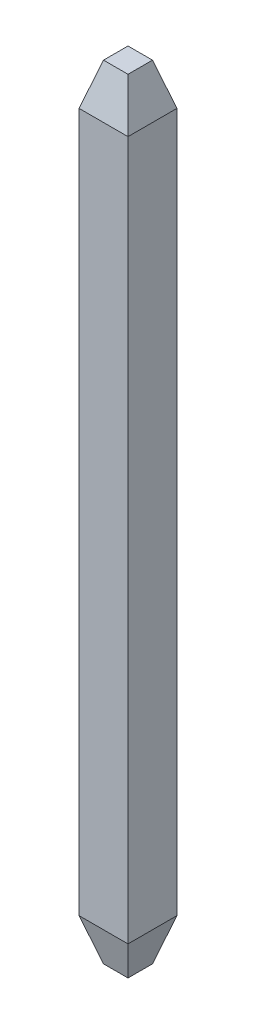
ISO-10303-21;
HEADER;
FILE_DESCRIPTION(('STEP AP214'),'2;1');
FILE_NAME('part.step','',(''),(''),'','','');
FILE_SCHEMA(('AUTOMOTIVE_DESIGN { 1 0 10303 214 1 1 1 1 }'));
ENDSEC;
DATA;
#1=APPLICATION_CONTEXT('core data for automotive mechanical design processes');
#2=APPLICATION_PROTOCOL_DEFINITION('international standard','automotive_design',2000,#1);
#3=PRODUCT_CONTEXT('',#1,'mechanical');
#4=PRODUCT('Part','Part','',(#3));
#5=PRODUCT_RELATED_PRODUCT_CATEGORY('part','',(#4));
#6=PRODUCT_DEFINITION_FORMATION('','',#4);
#7=PRODUCT_DEFINITION_CONTEXT('part definition',#1,'design');
#8=PRODUCT_DEFINITION('design','',#6,#7);
#9=PRODUCT_DEFINITION_SHAPE('','',#8);
#10=(LENGTH_UNIT() NAMED_UNIT(*) SI_UNIT(.MILLI.,.METRE.));
#11=(NAMED_UNIT(*) PLANE_ANGLE_UNIT() SI_UNIT($,.RADIAN.));
#12=(NAMED_UNIT(*) SI_UNIT($,.STERADIAN.) SOLID_ANGLE_UNIT());
#13=UNCERTAINTY_MEASURE_WITH_UNIT(LENGTH_MEASURE(1.E-05),#10,'distance_accuracy_value','');
#14=(GEOMETRIC_REPRESENTATION_CONTEXT(3) GLOBAL_UNCERTAINTY_ASSIGNED_CONTEXT((#13)) GLOBAL_UNIT_ASSIGNED_CONTEXT((#10,
#11,#12)) REPRESENTATION_CONTEXT('',''));
#15=CARTESIAN_POINT('',(0.,0.,0.));
#16=DIRECTION('',(0.,0.,1.));
#17=DIRECTION('',(1.,0.,0.));
#18=AXIS2_PLACEMENT_3D('',#15,#16,#17);
#19=CARTESIAN_POINT('',(1.11000000001295,-5.53543505344793,-16.6589999999763));
#20=DIRECTION('',(-1.,0.,0.));
#21=DIRECTION('',(0.,0.,1.));
#22=AXIS2_PLACEMENT_3D('',#19,#20,#21);
#23=PLANE('',#22);
#24=DIRECTION('',(0.,1.,0.));
#25=VECTOR('',#24,1.);
#26=CARTESIAN_POINT('',(1.11000000001295,-10.1039999999832,-17.2999999999763));
#27=LINE('',#26,#25);
#28=CARTESIAN_POINT('',(1.11000000001295,-10.1039999999832,-17.2999999999763));
#29=VERTEX_POINT('',#28);
#30=CARTESIAN_POINT('',(1.11000000001295,-0.965870106912663,-17.2999999999763));
#31=VERTEX_POINT('',#30);
#32=EDGE_CURVE('E169',#29,#31,#27,.T.);
#33=ORIENTED_EDGE('',*,*,#32,.F.);
#34=DIRECTION('',(0.,0.,-1.));
#35=VECTOR('',#34,1.);
#36=CARTESIAN_POINT('',(1.11000000001295,-10.1039999999832,-16.6599999999763));
#37=LINE('',#36,#35);
#38=CARTESIAN_POINT('',(1.11000000001295,-10.1039999999832,-16.6599999999763));
#39=VERTEX_POINT('',#38);
#40=EDGE_CURVE('E42',#39,#29,#37,.T.);
#41=ORIENTED_EDGE('',*,*,#40,.F.);
#42=DIRECTION('',(0.,1.,0.));
#43=VECTOR('',#42,1.);
#44=CARTESIAN_POINT('',(1.11000000001295,-10.1039999999832,-16.6599999999763));
#45=LINE('',#44,#43);
#46=CARTESIAN_POINT('',(1.11000000001295,-0.965870106912663,-16.6599999999763));
#47=VERTEX_POINT('',#46);
#48=EDGE_CURVE('E11',#39,#47,#45,.T.);
#49=ORIENTED_EDGE('',*,*,#48,.T.);
#50=DIRECTION('',(0.,0.,-1.));
#51=VECTOR('',#50,1.);
#52=CARTESIAN_POINT('',(1.11000000001295,-0.965870106912661,-16.6599999999763));
#53=LINE('',#52,#51);
#54=EDGE_CURVE('E28',#47,#31,#53,.T.);
#55=ORIENTED_EDGE('',*,*,#54,.T.);
#56=EDGE_LOOP('',(#33,#41,#49,#55));
#57=FACE_BOUND('',#56,.T.);
#58=ADVANCED_FACE('F17',(#57),#23,.T.);
#59=CARTESIAN_POINT('',(1.75100000001297,-5.53443505344793,-17.2999999999763));
#60=DIRECTION('',(0.,0.,-1.));
#61=DIRECTION('',(0.,-1.,0.));
#62=AXIS2_PLACEMENT_3D('',#59,#60,#61);
#63=PLANE('',#62);
#64=DIRECTION('',(0.,1.,0.));
#65=VECTOR('',#64,1.);
#66=CARTESIAN_POINT('',(1.75000000001297,-10.1039999999832,-17.2999999999763));
#67=LINE('',#66,#65);
#68=CARTESIAN_POINT('',(1.75000000001294,-10.1039999999832,-17.2999999999763));
#69=VERTEX_POINT('',#68);
#70=CARTESIAN_POINT('',(1.75000000001294,-0.965870106912663,-17.2999999999763));
#71=VERTEX_POINT('',#70);
#72=EDGE_CURVE('E119',#69,#71,#67,.T.);
#73=ORIENTED_EDGE('',*,*,#72,.F.);
#74=DIRECTION('',(1.,0.,0.));
#75=VECTOR('',#74,1.);
#76=CARTESIAN_POINT('',(1.11000000001295,-10.1039999999832,-17.2999999999763));
#77=LINE('',#76,#75);
#78=EDGE_CURVE('E102',#29,#69,#77,.T.);
#79=ORIENTED_EDGE('',*,*,#78,.F.);
#80=ORIENTED_EDGE('',*,*,#32,.T.);
#81=DIRECTION('',(1.,0.,0.));
#82=VECTOR('',#81,1.);
#83=CARTESIAN_POINT('',(1.11000000001295,-0.965870106912661,-17.2999999999763));
#84=LINE('',#83,#82);
#85=EDGE_CURVE('E140',#31,#71,#84,.T.);
#86=ORIENTED_EDGE('',*,*,#85,.T.);
#87=EDGE_LOOP('',(#73,#79,#80,#86));
#88=FACE_BOUND('',#87,.T.);
#89=ADVANCED_FACE('F234',(#88),#63,.T.);
#90=CARTESIAN_POINT('',(1.75000000001297,-11.0738701069127,-16.9799999999763));
#91=DIRECTION('',(1.,0.,0.));
#92=DIRECTION('',(0.,1.,0.));
#93=AXIS2_PLACEMENT_3D('',#90,#91,#92);
#94=PLANE('',#93);
#95=DIRECTION('',(0.,1.,0.));
#96=VECTOR('',#95,1.);
#97=CARTESIAN_POINT('',(1.75000000001297,-10.1039999999832,-16.6599999999763));
#98=LINE('',#97,#96);
#99=CARTESIAN_POINT('',(1.75000000001294,-10.1039999999832,-16.6599999999763));
#100=VERTEX_POINT('',#99);
#101=CARTESIAN_POINT('',(1.75000000001294,-0.965870106912663,-16.6599999999763));
#102=VERTEX_POINT('',#101);
#103=EDGE_CURVE('E163',#100,#102,#98,.T.);
#104=ORIENTED_EDGE('',*,*,#103,.F.);
#105=DIRECTION('',(0.,0.,1.));
#106=VECTOR('',#105,1.);
#107=CARTESIAN_POINT('',(1.75000000001297,-10.1039999999832,-17.2999999999763));
#108=LINE('',#107,#106);
#109=EDGE_CURVE('E109',#69,#100,#108,.T.);
#110=ORIENTED_EDGE('',*,*,#109,.F.);
#111=ORIENTED_EDGE('',*,*,#72,.T.);
#112=DIRECTION('',(0.,0.,1.));
#113=VECTOR('',#112,1.);
#114=CARTESIAN_POINT('',(1.75000000001297,-0.965870106912661,-17.2999999999763));
#115=LINE('',#114,#113);
#116=EDGE_CURVE('E115',#71,#102,#115,.T.);
#117=ORIENTED_EDGE('',*,*,#116,.T.);
#118=EDGE_LOOP('',(#104,#110,#111,#117));
#119=FACE_BOUND('',#118,.T.);
#120=ADVANCED_FACE('F230',(#119),#94,.T.);
#121=CARTESIAN_POINT('',(1.75000000001297,-0.965870106912661,-16.9799999999763));
#122=DIRECTION('',(0.959644900900968,0.281214622974643,0.));
#123=DIRECTION('',(0.,0.,-1.));
#124=AXIS2_PLACEMENT_3D('',#121,#122,#123);
#125=PLANE('',#124);
#126=DIRECTION('',(-0.270714017147727,0.923811583516618,0.270714017147727));
#127=VECTOR('',#126,1.);
#128=CARTESIAN_POINT('',(1.75000000001297,-0.965870106912661,-17.2999999999763));
#129=LINE('',#128,#127);
#130=CARTESIAN_POINT('',(1.59000000001294,-0.419870106912663,-17.1399999999763));
#131=VERTEX_POINT('',#130);
#132=EDGE_CURVE('E120',#71,#131,#129,.T.);
#133=ORIENTED_EDGE('',*,*,#132,.T.);
#134=DIRECTION('',(0.,0.,1.));
#135=VECTOR('',#134,1.);
#136=CARTESIAN_POINT('',(1.59000000001297,-0.419870106912661,-17.1399999999763));
#137=LINE('',#136,#135);
#138=CARTESIAN_POINT('',(1.59000000001294,-0.419870106912663,-16.8199999999763));
#139=VERTEX_POINT('',#138);
#140=EDGE_CURVE('E127',#131,#139,#137,.T.);
#141=ORIENTED_EDGE('',*,*,#140,.T.);
#142=DIRECTION('',(-0.270714017147727,0.923811583516618,-0.270714017147727));
#143=VECTOR('',#142,1.);
#144=CARTESIAN_POINT('',(1.75000000001297,-0.965870106912661,-16.6599999999763));
#145=LINE('',#144,#143);
#146=EDGE_CURVE('E126',#102,#139,#145,.T.);
#147=ORIENTED_EDGE('',*,*,#146,.F.);
#148=ORIENTED_EDGE('',*,*,#116,.F.);
#149=EDGE_LOOP('',(#133,#141,#147,#148));
#150=FACE_BOUND('',#149,.T.);
#151=ADVANCED_FACE('F398',(#150),#125,.T.);
#152=CARTESIAN_POINT('',(1.43000000001296,-0.965870106912661,-16.6599999999763));
#153=DIRECTION('',(0.,0.281214622974643,0.959644900900968));
#154=DIRECTION('',(1.,0.,0.));
#155=AXIS2_PLACEMENT_3D('',#152,#153,#154);
#156=PLANE('',#155);
#157=ORIENTED_EDGE('',*,*,#146,.T.);
#158=DIRECTION('',(-1.,0.,0.));
#159=VECTOR('',#158,1.);
#160=CARTESIAN_POINT('',(1.59000000001297,-0.419870106912661,-16.8199999999763));
#161=LINE('',#160,#159);
#162=CARTESIAN_POINT('',(1.27000000001295,-0.419870106912663,-16.8199999999763));
#163=VERTEX_POINT('',#162);
#164=EDGE_CURVE('E113',#139,#163,#161,.T.);
#165=ORIENTED_EDGE('',*,*,#164,.T.);
#166=DIRECTION('',(0.270714017147727,0.923811583516618,-0.270714017147727));
#167=VECTOR('',#166,1.);
#168=CARTESIAN_POINT('',(1.11000000001295,-0.965870106912661,-16.6599999999763));
#169=LINE('',#168,#167);
#170=EDGE_CURVE('E148',#47,#163,#169,.T.);
#171=ORIENTED_EDGE('',*,*,#170,.F.);
#172=DIRECTION('',(-1.,0.,0.));
#173=VECTOR('',#172,1.);
#174=CARTESIAN_POINT('',(1.75000000001297,-0.965870106912661,-16.6599999999763));
#175=LINE('',#174,#173);
#176=EDGE_CURVE('E98',#102,#47,#175,.T.);
#177=ORIENTED_EDGE('',*,*,#176,.F.);
#178=EDGE_LOOP('',(#157,#165,#171,#177));
#179=FACE_BOUND('',#178,.T.);
#180=ADVANCED_FACE('F389',(#179),#156,.T.);
#181=CARTESIAN_POINT('',(1.43000000001296,-0.419870106912661,-17.1409999999763));
#182=DIRECTION('',(0.,1.,0.));
#183=DIRECTION('',(1.,0.,0.));
#184=AXIS2_PLACEMENT_3D('',#181,#182,#183);
#185=PLANE('',#184);
#186=DIRECTION('',(1.,0.,0.));
#187=VECTOR('',#186,1.);
#188=CARTESIAN_POINT('',(1.27000000001295,-0.419870106912661,-17.1399999999763));
#189=LINE('',#188,#187);
#190=CARTESIAN_POINT('',(1.27000000001295,-0.419870106912663,-17.1399999999763));
#191=VERTEX_POINT('',#190);
#192=EDGE_CURVE('E105',#191,#131,#189,.T.);
#193=ORIENTED_EDGE('',*,*,#192,.F.);
#194=DIRECTION('',(0.,0.,-1.));
#195=VECTOR('',#194,1.);
#196=CARTESIAN_POINT('',(1.27000000001295,-0.419870106912661,-16.8199999999763));
#197=LINE('',#196,#195);
#198=EDGE_CURVE('E153',#163,#191,#197,.T.);
#199=ORIENTED_EDGE('',*,*,#198,.F.);
#200=ORIENTED_EDGE('',*,*,#164,.F.);
#201=ORIENTED_EDGE('',*,*,#140,.F.);
#202=EDGE_LOOP('',(#193,#199,#200,#201));
#203=FACE_BOUND('',#202,.T.);
#204=ADVANCED_FACE('F381',(#203),#185,.T.);
#205=CARTESIAN_POINT('',(1.75000000001297,-10.1039999999832,-16.9799999999763));
#206=DIRECTION('',(0.959644900900968,-0.281214622974643,0.));
#207=DIRECTION('',(0.,0.,-1.));
#208=AXIS2_PLACEMENT_3D('',#205,#206,#207);
#209=PLANE('',#208);
#210=ORIENTED_EDGE('',*,*,#109,.T.);
#211=DIRECTION('',(-0.270714017147727,-0.923811583516618,-0.270714017147727));
#212=VECTOR('',#211,1.);
#213=CARTESIAN_POINT('',(1.75000000001297,-10.1039999999832,-16.6599999999763));
#214=LINE('',#213,#212);
#215=CARTESIAN_POINT('',(1.59000000001294,-10.6499999999832,-16.8199999999763));
#216=VERTEX_POINT('',#215);
#217=EDGE_CURVE('E114',#100,#216,#214,.T.);
#218=ORIENTED_EDGE('',*,*,#217,.T.);
#219=DIRECTION('',(0.,0.,1.));
#220=VECTOR('',#219,1.);
#221=CARTESIAN_POINT('',(1.59000000001297,-10.6499999999832,-17.1399999999763));
#222=LINE('',#221,#220);
#223=CARTESIAN_POINT('',(1.59000000001294,-10.6499999999832,-17.1399999999763));
#224=VERTEX_POINT('',#223);
#225=EDGE_CURVE('E108',#224,#216,#222,.T.);
#226=ORIENTED_EDGE('',*,*,#225,.F.);
#227=DIRECTION('',(-0.270714017147727,-0.923811583516618,0.270714017147727));
#228=VECTOR('',#227,1.);
#229=CARTESIAN_POINT('',(1.75000000001297,-10.1039999999832,-17.2999999999763));
#230=LINE('',#229,#228);
#231=EDGE_CURVE('E78',#69,#224,#230,.T.);
#232=ORIENTED_EDGE('',*,*,#231,.F.);
#233=EDGE_LOOP('',(#210,#218,#226,#232));
#234=FACE_BOUND('',#233,.T.);
#235=ADVANCED_FACE('F235',(#234),#209,.T.);
#236=CARTESIAN_POINT('',(1.26900000001297,-10.6499999999832,-16.9799999999763));
#237=DIRECTION('',(0.,-1.,0.));
#238=DIRECTION('',(0.,0.,-1.));
#239=AXIS2_PLACEMENT_3D('',#236,#237,#238);
#240=PLANE('',#239);
#241=ORIENTED_EDGE('',*,*,#225,.T.);
#242=DIRECTION('',(-1.,0.,0.));
#243=VECTOR('',#242,1.);
#244=CARTESIAN_POINT('',(1.59000000001297,-10.6499999999832,-16.8199999999763));
#245=LINE('',#244,#243);
#246=CARTESIAN_POINT('',(1.27000000001295,-10.6499999999832,-16.8199999999763));
#247=VERTEX_POINT('',#246);
#248=EDGE_CURVE('E87',#216,#247,#245,.T.);
#249=ORIENTED_EDGE('',*,*,#248,.T.);
#250=DIRECTION('',(0.,0.,-1.));
#251=VECTOR('',#250,1.);
#252=CARTESIAN_POINT('',(1.27000000001295,-10.6499999999832,-16.8199999999763));
#253=LINE('',#252,#251);
#254=CARTESIAN_POINT('',(1.27000000001295,-10.6499999999832,-17.1399999999763));
#255=VERTEX_POINT('',#254);
#256=EDGE_CURVE('E61',#247,#255,#253,.T.);
#257=ORIENTED_EDGE('',*,*,#256,.T.);
#258=DIRECTION('',(1.,0.,0.));
#259=VECTOR('',#258,1.);
#260=CARTESIAN_POINT('',(1.27000000001295,-10.6499999999832,-17.1399999999763));
#261=LINE('',#260,#259);
#262=EDGE_CURVE('E73',#255,#224,#261,.T.);
#263=ORIENTED_EDGE('',*,*,#262,.T.);
#264=EDGE_LOOP('',(#241,#249,#257,#263));
#265=FACE_BOUND('',#264,.T.);
#266=ADVANCED_FACE('F85',(#265),#240,.T.);
#267=CARTESIAN_POINT('',(1.43000000001296,-10.1039999999832,-16.6599999999763));
#268=DIRECTION('',(0.,-0.281214622974643,0.959644900900968));
#269=DIRECTION('',(-1.,0.,0.));
#270=AXIS2_PLACEMENT_3D('',#267,#268,#269);
#271=PLANE('',#270);
#272=DIRECTION('',(-1.,0.,0.));
#273=VECTOR('',#272,1.);
#274=CARTESIAN_POINT('',(1.75000000001297,-10.1039999999832,-16.6599999999763));
#275=LINE('',#274,#273);
#276=EDGE_CURVE('E83',#100,#39,#275,.T.);
#277=ORIENTED_EDGE('',*,*,#276,.T.);
#278=DIRECTION('',(0.270714017147727,-0.923811583516618,-0.270714017147727));
#279=VECTOR('',#278,1.);
#280=CARTESIAN_POINT('',(1.11000000001295,-10.1039999999832,-16.6599999999763));
#281=LINE('',#280,#279);
#282=EDGE_CURVE('E21',#39,#247,#281,.T.);
#283=ORIENTED_EDGE('',*,*,#282,.T.);
#284=ORIENTED_EDGE('',*,*,#248,.F.);
#285=ORIENTED_EDGE('',*,*,#217,.F.);
#286=EDGE_LOOP('',(#277,#283,#284,#285));
#287=FACE_BOUND('',#286,.T.);
#288=ADVANCED_FACE('F19',(#287),#271,.T.);
#289=CARTESIAN_POINT('',(1.43000000001296,-0.965870106912661,-17.2999999999763));
#290=DIRECTION('',(0.,0.281214622974643,-0.959644900900968));
#291=DIRECTION('',(-1.,0.,0.));
#292=AXIS2_PLACEMENT_3D('',#289,#290,#291);
#293=PLANE('',#292);
#294=DIRECTION('',(0.270714017147727,0.923811583516618,0.270714017147727));
#295=VECTOR('',#294,1.);
#296=CARTESIAN_POINT('',(1.11000000001295,-0.965870106912661,-17.2999999999763));
#297=LINE('',#296,#295);
#298=EDGE_CURVE('E144',#31,#191,#297,.T.);
#299=ORIENTED_EDGE('',*,*,#298,.T.);
#300=ORIENTED_EDGE('',*,*,#192,.T.);
#301=ORIENTED_EDGE('',*,*,#132,.F.);
#302=ORIENTED_EDGE('',*,*,#85,.F.);
#303=EDGE_LOOP('',(#299,#300,#301,#302));
#304=FACE_BOUND('',#303,.T.);
#305=ADVANCED_FACE('F201',(#304),#293,.T.);
#306=CARTESIAN_POINT('',(1.43000000001296,-10.1039999999832,-17.2999999999763));
#307=DIRECTION('',(0.,-0.281214622974643,-0.959644900900968));
#308=DIRECTION('',(0.,-0.959644900900968,0.281214622974643));
#309=AXIS2_PLACEMENT_3D('',#306,#307,#308);
#310=PLANE('',#309);
#311=ORIENTED_EDGE('',*,*,#78,.T.);
#312=ORIENTED_EDGE('',*,*,#231,.T.);
#313=ORIENTED_EDGE('',*,*,#262,.F.);
#314=DIRECTION('',(0.270714017147727,-0.923811583516618,0.270714017147727));
#315=VECTOR('',#314,1.);
#316=CARTESIAN_POINT('',(1.11000000001295,-10.1039999999832,-17.2999999999763));
#317=LINE('',#316,#315);
#318=EDGE_CURVE('E76',#29,#255,#317,.T.);
#319=ORIENTED_EDGE('',*,*,#318,.F.);
#320=EDGE_LOOP('',(#311,#312,#313,#319));
#321=FACE_BOUND('',#320,.T.);
#322=ADVANCED_FACE('F75',(#321),#310,.T.);
#323=CARTESIAN_POINT('',(1.11000000001295,-0.965870106912661,-16.9799999999763));
#324=DIRECTION('',(-0.959644900900968,0.281214622974643,0.));
#325=DIRECTION('',(0.,0.,1.));
#326=AXIS2_PLACEMENT_3D('',#323,#324,#325);
#327=PLANE('',#326);
#328=ORIENTED_EDGE('',*,*,#170,.T.);
#329=ORIENTED_EDGE('',*,*,#198,.T.);
#330=ORIENTED_EDGE('',*,*,#298,.F.);
#331=ORIENTED_EDGE('',*,*,#54,.F.);
#332=EDGE_LOOP('',(#328,#329,#330,#331));
#333=FACE_BOUND('',#332,.T.);
#334=ADVANCED_FACE('F196',(#333),#327,.T.);
#335=CARTESIAN_POINT('',(1.10900000001298,-5.53543505344793,-16.6599999999763));
#336=DIRECTION('',(0.,0.,1.));
#337=DIRECTION('',(1.,0.,0.));
#338=AXIS2_PLACEMENT_3D('',#335,#336,#337);
#339=PLANE('',#338);
#340=ORIENTED_EDGE('',*,*,#48,.F.);
#341=ORIENTED_EDGE('',*,*,#276,.F.);
#342=ORIENTED_EDGE('',*,*,#103,.T.);
#343=ORIENTED_EDGE('',*,*,#176,.T.);
#344=EDGE_LOOP('',(#340,#341,#342,#343));
#345=FACE_BOUND('',#344,.T.);
#346=ADVANCED_FACE('F321',(#345),#339,.T.);
#347=CARTESIAN_POINT('',(1.11000000001295,-10.1039999999832,-16.9799999999763));
#348=DIRECTION('',(-0.959644900900968,-0.281214622974643,0.));
#349=DIRECTION('',(-0.281214622974643,0.959644900900968,0.));
#350=AXIS2_PLACEMENT_3D('',#347,#348,#349);
#351=PLANE('',#350);
#352=ORIENTED_EDGE('',*,*,#40,.T.);
#353=ORIENTED_EDGE('',*,*,#318,.T.);
#354=ORIENTED_EDGE('',*,*,#256,.F.);
#355=ORIENTED_EDGE('',*,*,#282,.F.);
#356=EDGE_LOOP('',(#352,#353,#354,#355));
#357=FACE_BOUND('',#356,.T.);
#358=ADVANCED_FACE('F91',(#357),#351,.T.);
#359=CLOSED_SHELL('',(#58,#89,#120,#151,#180,#204,#235,#266,#288,#305,#322,#334,#346,#358));
#360=MANIFOLD_SOLID_BREP('B1',#359);
#361=ADVANCED_BREP_SHAPE_REPRESENTATION('',(#18,#360),#14);
#362=SHAPE_DEFINITION_REPRESENTATION(#9,#361);
ENDSEC;
END-ISO-10303-21;
